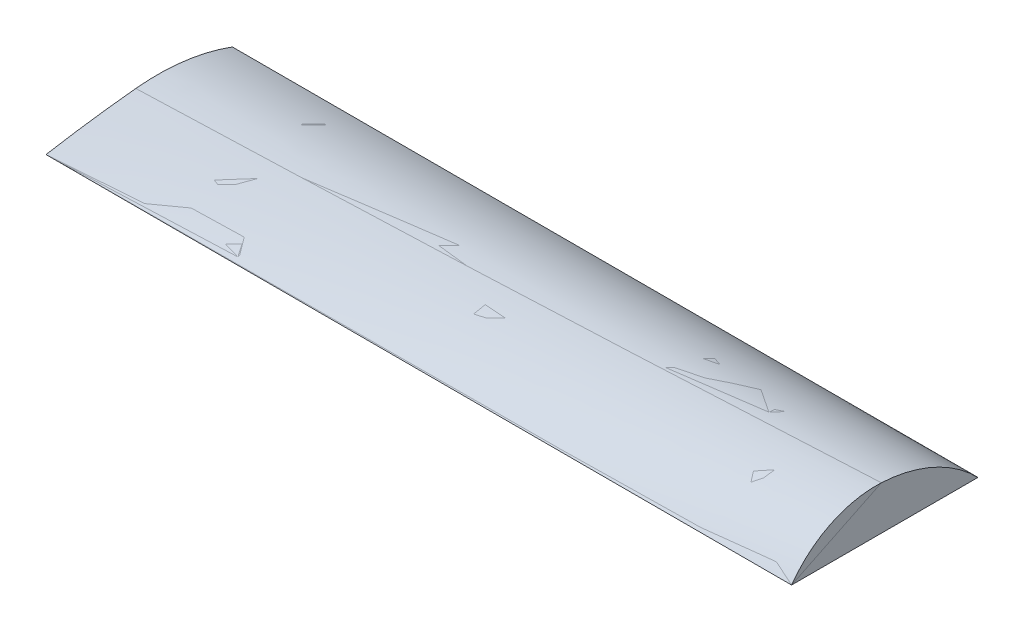
ISO-10303-21;
HEADER;
FILE_DESCRIPTION(('STEP AP214'),'2;1');
FILE_NAME('part.step','',(''),(''),'','','');
FILE_SCHEMA(('AUTOMOTIVE_DESIGN { 1 0 10303 214 1 1 1 1 }'));
ENDSEC;
DATA;
#1=APPLICATION_CONTEXT('core data for automotive mechanical design processes');
#2=APPLICATION_PROTOCOL_DEFINITION('international standard','automotive_design',2000,#1);
#3=PRODUCT_CONTEXT('',#1,'mechanical');
#4=PRODUCT('Part','Part','',(#3));
#5=PRODUCT_RELATED_PRODUCT_CATEGORY('part','',(#4));
#6=PRODUCT_DEFINITION_FORMATION('','',#4);
#7=PRODUCT_DEFINITION_CONTEXT('part definition',#1,'design');
#8=PRODUCT_DEFINITION('design','',#6,#7);
#9=PRODUCT_DEFINITION_SHAPE('','',#8);
#10=(LENGTH_UNIT() NAMED_UNIT(*) SI_UNIT(.MILLI.,.METRE.));
#11=(NAMED_UNIT(*) PLANE_ANGLE_UNIT() SI_UNIT($,.RADIAN.));
#12=(NAMED_UNIT(*) SI_UNIT($,.STERADIAN.) SOLID_ANGLE_UNIT());
#13=UNCERTAINTY_MEASURE_WITH_UNIT(LENGTH_MEASURE(1.E-05),#10,'distance_accuracy_value','');
#14=(GEOMETRIC_REPRESENTATION_CONTEXT(3) GLOBAL_UNCERTAINTY_ASSIGNED_CONTEXT((#13)) GLOBAL_UNIT_ASSIGNED_CONTEXT((#10,
#11,#12)) REPRESENTATION_CONTEXT('',''));
#15=CARTESIAN_POINT('',(0.,0.,0.));
#16=DIRECTION('',(0.,0.,1.));
#17=DIRECTION('',(1.,0.,0.));
#18=AXIS2_PLACEMENT_3D('',#15,#16,#17);
#19=CARTESIAN_POINT('',(3048.,357.029468650609,27.7196009830328));
#20=CARTESIAN_POINT('',(2032.06565410916,305.807060138827,27.7196009830331));
#21=CARTESIAN_POINT('',(0.459460026641767,203.375477990563,27.7196009830337));
#22=CARTESIAN_POINT('',(-2031.93437981395,135.09915754925,27.7196009830325));
#23=CARTESIAN_POINT('',(-3048.,100.965408217149,27.7196009830318));
#24=CARTESIAN_POINT('',(3048.,355.088474416726,-9.18765761877458));
#25=CARTESIAN_POINT('',(2032.06565410916,305.416517274933,-8.33612498554589));
#26=CARTESIAN_POINT('',(0.459460026641767,206.085437260132,-6.63327973857884));
#27=CARTESIAN_POINT('',(-2031.93437981395,138.256317849937,-5.9257886405661));
#28=CARTESIAN_POINT('',(-3048.,104.346140142649,-5.57208879795351));
#29=CARTESIAN_POINT('',(3048.,347.771369274783,-82.8214757845803));
#30=CARTESIAN_POINT('',(2032.06565410916,301.400034870182,-80.4082955218791));
#31=CARTESIAN_POINT('',(0.459460026641989,208.669347512968,-75.5825585153776));
#32=CARTESIAN_POINT('',(-2031.93437981395,142.356994766912,-73.426514928613));
#33=CARTESIAN_POINT('',(-3048.,109.205102403273,-72.3486324231701));
#34=CARTESIAN_POINT('',(3048.,326.584084138001,-191.775336090493));
#35=CARTESIAN_POINT('',(2032.06565410916,285.718343395966,-187.533693604311));
#36=CARTESIAN_POINT('',(0.459460026641101,203.997420825434,-179.051504589966));
#37=CARTESIAN_POINT('',(-2031.93437981395,141.843835621411,-174.860976147701));
#38=CARTESIAN_POINT('',(-3048.,110.771058357894,-172.765982649329));
#39=CARTESIAN_POINT('',(3048.,295.369062928028,-298.290389942061));
#40=CARTESIAN_POINT('',(2032.06565410916,260.50899486405,-292.819188382958));
#41=CARTESIAN_POINT('',(0.459460026640546,190.797865900481,-281.878198916951));
#42=CARTESIAN_POINT('',(-2031.93437981395,134.663233778749,-276.03175468013));
#43=CARTESIAN_POINT('',(-3048.,106.599544211004,-273.108910262419));
#44=CARTESIAN_POINT('',(3047.99999999999,254.39579806938,-401.445762945769));
#45=CARTESIAN_POINT('',(2032.06565410915,225.974502752165,-395.42274883089));
#46=CARTESIAN_POINT('',(0.459460026644765,169.139255628326,-383.378276830975));
#47=CARTESIAN_POINT('',(-2031.93437981395,120.853606673482,-376.493025001473));
#48=CARTESIAN_POINT('',(-3048.,96.7139016174797,-373.050843898016));
#49=CARTESIAN_POINT('',(3048.00000000001,204.018747874501,-500.349717499533));
#50=CARTESIAN_POINT('',(2032.06565410916,182.393619242813,-494.524216022473));
#51=CARTESIAN_POINT('',(0.459460026640546,139.148949492579,-482.874718264766));
#52=CARTESIAN_POINT('',(-2031.93437981395,100.472965583307,-475.801409575772));
#53=CARTESIAN_POINT('',(-3048.,81.1374722321939,-472.265212191698));
#54=CARTESIAN_POINT('',(3047.99999999999,144.673229990741,-594.147072223697));
#55=CARTESIAN_POINT('',(2032.06565410915,130.115112109361,-589.331310253587));
#56=CARTESIAN_POINT('',(0.459460026644321,101.002637881453,-579.701030612708));
#57=CARTESIAN_POINT('',(-2031.93437981395,73.6195841472809,-573.52012772952));
#58=CARTESIAN_POINT('',(-3048.,59.9298263210211,-570.43007559582));
#59=CARTESIAN_POINT('',(3048.00000000001,76.8725640331372,-682.027186144494));
#60=CARTESIAN_POINT('',(2032.06565410916,69.5587832278572,-679.086866649359));
#61=CARTESIAN_POINT('',(0.459460026639436,54.9331113561778,-673.206987380527));
#62=CARTESIAN_POINT('',(-2031.93437981395,40.4107677559007,-669.21782035926));
#63=CARTESIAN_POINT('',(-3048.,33.1505341498355,-667.223494562737));
#64=CARTESIAN_POINT('',(3048.,26.4258089430827,-736.162240464383));
#65=CARTESIAN_POINT('',(2032.06565410916,23.9914846027125,-735.077740652571));
#66=CARTESIAN_POINT('',(0.459460026641767,19.1234649040918,-732.90902124263));
#67=CARTESIAN_POINT('',(-2031.93437981395,14.1394388830836,-731.389406125531));
#68=CARTESIAN_POINT('',(-3048.,11.6477478580526,-730.629696739421));
#69=CARTESIAN_POINT('',(3048.,2.22044604925031E-13,-762.));
#70=CARTESIAN_POINT('',(2032.06565410916,0.,-762.));
#71=CARTESIAN_POINT('',(0.459460026641767,-4.99617109103717E-13,-762.000000000001));
#72=CARTESIAN_POINT('',(-2031.93437981395,1.29547534353127E-13,-762.));
#73=CARTESIAN_POINT('',(-3048.,4.44089209850063E-13,-762.));
#74=B_SPLINE_SURFACE_WITH_KNOTS('',3,3,((#19,#20,#21,#22,#23),(#24,#25,#26,#27,#28),(#29,#30,
#31,#32,#33),(#34,#35,#36,#37,#38),(#39,#40,#41,#42,#43),(#44,#45,#46,#47,#48),(#49,#50,#51,#52,
#53),(#54,#55,#56,#57,#58),(#59,#60,#61,#62,#63),(#64,#65,#66,#67,#68),(#69,#70,#71,#72,#73)),
.UNSPECIFIED.,.F.,.F.,.F.,(4,1,1,1,1,1,1,1,4),(4,1,4),(0.,0.125,0.25,0.375,0.5,0.625,0.75,0.875,
1.),(0.,0.500064603489578,1.),.UNSPECIFIED.);
#75=CARTESIAN_POINT('',(3048.,-833.356731227227,90.3233498819976));
#76=DIRECTION('',(-1.,0.,0.));
#77=DIRECTION('',(0.,0.,-1.));
#78=AXIS2_PLACEMENT_3D('',#75,#76,#77);
#79=CIRCLE('',#78,1192.03126395066);
#80=CARTESIAN_POINT('',(3048.,357.029468650609,27.7196009830328));
#81=VERTEX_POINT('',#80);
#82=CARTESIAN_POINT('',(3048.,2.22044604925031E-13,-762.));
#83=VERTEX_POINT('',#82);
#84=EDGE_CURVE('E173',#81,#83,#79,.T.);
#85=DIRECTION('',(-1.,0.,0.));
#86=VECTOR('',#85,1.);
#87=CARTESIAN_POINT('',(0.393822875752819,0.,-762.));
#88=LINE('',#87,#86);
#89=CARTESIAN_POINT('',(-3048.,2.22044604925031E-13,-762.));
#90=VERTEX_POINT('',#89);
#91=EDGE_CURVE('E176',#83,#90,#88,.T.);
#92=CARTESIAN_POINT('',(-3048.,-1648.45305250207,-149.931785297438));
#93=DIRECTION('',(-1.,0.,0.));
#94=DIRECTION('',(0.,0.,-1.));
#95=AXIS2_PLACEMENT_3D('',#92,#93,#94);
#96=CIRCLE('',#95,1758.41547017551);
#97=CARTESIAN_POINT('',(-3048.,100.965408217149,27.7196009830318));
#98=VERTEX_POINT('',#97);
#99=EDGE_CURVE('E191',#98,#90,#96,.T.);
#100=CARTESIAN_POINT('',(3048.,357.029468650609,27.7196009830328));
#101=CARTESIAN_POINT('',(2032.06565410916,305.807060138827,27.7196009830331));
#102=CARTESIAN_POINT('',(0.459460026641767,203.375477990563,27.7196009830336));
#103=CARTESIAN_POINT('',(-2031.93437981395,135.09915754925,27.7196009830324));
#104=CARTESIAN_POINT('',(-3048.,100.965408217149,27.7196009830318));
#105=B_SPLINE_CURVE_WITH_KNOTS('',3,(#100,#101,#102,#103,#104),.UNSPECIFIED.,.F.,.F.,(4,1,4),
(0.,0.500064603489578,1.),.UNSPECIFIED.);
#106=EDGE_CURVE('E179',#81,#98,#105,.T.);
#107=ORIENTED_EDGE('',*,*,#84,.T.);
#108=ORIENTED_EDGE('',*,*,#91,.T.);
#109=ORIENTED_EDGE('',*,*,#99,.F.);
#110=ORIENTED_EDGE('',*,*,#106,.F.);
#111=EDGE_LOOP('',(#107,#108,#109,#110));
#112=FACE_BOUND('',#111,.T.);
#113=ADVANCED_FACE('F133',(#112),#74,.T.);
#114=CARTESIAN_POINT('',(3048.,1.66533453693773E-13,762.));
#115=CARTESIAN_POINT('',(2032.06565410916,2.0817458848352E-13,762.));
#116=CARTESIAN_POINT('',(0.459460026641767,2.91446098802716E-13,761.999999999999));
#117=CARTESIAN_POINT('',(-2031.93437981395,0.,762.));
#118=CARTESIAN_POINT('',(-3048.,0.,762.));
#119=CARTESIAN_POINT('',(3048.,29.0429711531695,741.566544907392));
#120=CARTESIAN_POINT('',(2032.06565410916,24.2371026730112,738.550355351954));
#121=CARTESIAN_POINT('',(0.459460026641767,14.6266074557498,732.518755565864));
#122=CARTESIAN_POINT('',(-2031.93437981395,8.4016222990255,731.884160631592));
#123=CARTESIAN_POINT('',(-3048.,5.28953187642705,731.566904161504));
#124=CARTESIAN_POINT('',(3048.,84.5453723552376,697.027775172461));
#125=CARTESIAN_POINT('',(2032.06565410916,70.4457511191001,689.08358478242));
#126=CARTESIAN_POINT('',(0.459460026641323,42.2501517150495,673.197256626809));
#127=CARTESIAN_POINT('',(-2031.93437981395,24.4819010655734,671.501573315269));
#128=CARTESIAN_POINT('',(-3048.,15.5989236318311,670.653841206558));
#129=CARTESIAN_POINT('',(3048.,158.721372485365,620.265381851068));
#130=CARTESIAN_POINT('',(2032.06565410916,132.12375937084,607.933020626898));
#131=CARTESIAN_POINT('',(0.459460026642766,78.9354054483259,583.271484621126));
#132=CARTESIAN_POINT('',(-2031.93437981395,46.4789445969054,580.524251156607));
#133=CARTESIAN_POINT('',(-3048.,30.2528109718255,579.150811905216));
#134=CARTESIAN_POINT('',(3048.00000000001,222.639379242981,534.772697088081));
#135=CARTESIAN_POINT('',(2032.06565410916,185.414016794622,520.678936224319));
#136=CARTESIAN_POINT('',(0.459460026639769,110.972910208411,492.495056050811));
#137=CARTESIAN_POINT('',(-2031.93437981395,66.3859255649033,489.179227007448));
#138=CARTESIAN_POINT('',(-3048.,44.0953137179471,487.521526699893));
#139=CARTESIAN_POINT('',(3047.99999999999,275.280986029378,441.910495941741));
#140=CARTESIAN_POINT('',(2032.06565410915,229.67378287563,428.254517465996));
#141=CARTESIAN_POINT('',(0.459460026644987,138.47116058345,400.94608895406));
#142=CARTESIAN_POINT('',(-2031.93437981395,84.238303362931,397.497337764328));
#143=CARTESIAN_POINT('',(-3048.,57.1253783844976,395.773184970824));
#144=CARTESIAN_POINT('',(3048.,315.808296145767,343.157955207196));
#145=CARTESIAN_POINT('',(2032.06565410916,264.365612597069,331.662016648247));
#146=CARTESIAN_POINT('',(0.459460026640768,161.493537289764,308.67310985755));
#147=CARTESIAN_POINT('',(-2031.93437981395,100.056500722473,305.499557336302));
#148=CARTESIAN_POINT('',(-3048.,69.3419514857788,303.912986098246));
#149=CARTESIAN_POINT('',(3048.,343.575379924687,240.087591890367));
#150=CARTESIAN_POINT('',(2032.06565410916,289.07946806479,231.962587520926));
#151=CARTESIAN_POINT('',(0.459460026640768,180.101725029969,215.714678125336));
#152=CARTESIAN_POINT('',(-2031.93437981395,113.860458253997,213.203548966914));
#153=CARTESIAN_POINT('',(-3048.,80.7441042829981,211.94814661541));
#154=CARTESIAN_POINT('',(3047.99999999999,358.140910336441,134.340774692125));
#155=CARTESIAN_POINT('',(2032.06565410915,303.52466072033,130.257546581266));
#156=CARTESIAN_POINT('',(0.459460026642988,194.306273266018,122.092145386369));
#157=CARTESIAN_POINT('',(-2031.93437981395,125.653072956041,120.621240482108));
#158=CARTESIAN_POINT('',(-3048.,91.3309080373627,119.885883055567));
#159=CARTESIAN_POINT('',(3048.,358.894446710407,63.1814412802017));
#160=CARTESIAN_POINT('',(2032.06565410916,306.207053153412,61.8698764540038));
#161=CARTESIAN_POINT('',(0.459460026641767,200.845879438396,59.2470856844804));
#162=CARTESIAN_POINT('',(-2031.93437981395,132.1754553575,58.7162808688702));
#163=CARTESIAN_POINT('',(-3048.,97.8446796660789,58.4509127529084));
#164=CARTESIAN_POINT('',(3048.,357.029468650609,27.7196009830328));
#165=CARTESIAN_POINT('',(2032.06565410916,305.807060138827,27.7196009830331));
#166=CARTESIAN_POINT('',(0.459460026641767,203.375477990563,27.7196009830336));
#167=CARTESIAN_POINT('',(-2031.93437981395,135.09915754925,27.7196009830324));
#168=CARTESIAN_POINT('',(-3048.,100.965408217149,27.7196009830318));
#169=B_SPLINE_SURFACE_WITH_KNOTS('',3,3,((#114,#115,#116,#117,#118),(#119,#120,#121,#122,#123),
(#124,#125,#126,#127,#128),(#129,#130,#131,#132,#133),(#134,#135,#136,#137,#138),(#139,#140,
#141,#142,#143),(#144,#145,#146,#147,#148),(#149,#150,#151,#152,#153),(#154,#155,#156,#157,
#158),(#159,#160,#161,#162,#163),(#164,#165,#166,#167,#168)),.UNSPECIFIED.,.F.,.F.,.F.,(4,1,1,1,
1,1,1,1,4),(4,1,4),(0.,0.125,0.25,0.375,0.5,0.625,0.75,0.875,1.),(0.,0.500064603489578,1.),.UNSPECIFIED.);
#170=CARTESIAN_POINT('',(3048.,-485.437757623856,72.0258998083268));
#171=DIRECTION('',(-1.,0.,0.));
#172=DIRECTION('',(0.,0.,-1.));
#173=AXIS2_PLACEMENT_3D('',#170,#171,#172);
#174=CIRCLE('',#173,843.631480838753);
#175=CARTESIAN_POINT('',(3048.,1.66533453693773E-13,762.));
#176=VERTEX_POINT('',#175);
#177=EDGE_CURVE('E150',#176,#81,#174,.T.);
#178=CARTESIAN_POINT('',(-3048.,-10303.5740928413,-1028.84914313158));
#179=DIRECTION('',(-1.,0.,0.));
#180=DIRECTION('',(0.,0.,-1.));
#181=AXIS2_PLACEMENT_3D('',#178,#179,#180);
#182=CIRCLE('',#181,10458.048562716);
#183=CARTESIAN_POINT('',(-3048.,0.,762.));
#184=VERTEX_POINT('',#183);
#185=EDGE_CURVE('E158',#184,#98,#182,.T.);
#186=DIRECTION('',(-1.,0.,0.));
#187=VECTOR('',#186,1.);
#188=CARTESIAN_POINT('',(0.393822875752819,2.22055364725921E-13,761.999999999999));
#189=LINE('',#188,#187);
#190=EDGE_CURVE('E235',#176,#184,#189,.T.);
#191=ORIENTED_EDGE('',*,*,#177,.T.);
#192=ORIENTED_EDGE('',*,*,#106,.T.);
#193=ORIENTED_EDGE('',*,*,#185,.F.);
#194=ORIENTED_EDGE('',*,*,#190,.F.);
#195=EDGE_LOOP('',(#191,#192,#193,#194));
#196=FACE_BOUND('',#195,.T.);
#197=ADVANCED_FACE('F264',(#196),#169,.T.);
#198=CARTESIAN_POINT('',(-3048.,-10303.5740928413,-1028.84914313158));
#199=DIRECTION('',(-1.,0.,0.));
#200=DIRECTION('',(0.,0.,1.));
#201=AXIS2_PLACEMENT_3D('',#198,#199,#200);
#202=PLANE('',#201);
#203=ORIENTED_EDGE('',*,*,#99,.T.);
#204=DIRECTION('',(0.,0.,1.));
#205=VECTOR('',#204,1.);
#206=CARTESIAN_POINT('',(-3048.,1.11022302462516E-13,0.));
#207=LINE('',#206,#205);
#208=EDGE_CURVE('E143',#90,#184,#207,.T.);
#209=ORIENTED_EDGE('',*,*,#208,.T.);
#210=ORIENTED_EDGE('',*,*,#185,.T.);
#211=EDGE_LOOP('',(#203,#209,#210));
#212=FACE_BOUND('',#211,.T.);
#213=ADVANCED_FACE('F245',(#212),#202,.T.);
#214=CARTESIAN_POINT('',(3048.,2.22044604925031E-13,-762.));
#215=DIRECTION('',(0.,-1.,0.));
#216=DIRECTION('',(0.,0.,1.));
#217=AXIS2_PLACEMENT_3D('',#214,#215,#216);
#218=PLANE('',#217);
#219=DIRECTION('',(0.,0.,1.));
#220=VECTOR('',#219,1.);
#221=CARTESIAN_POINT('',(3048.,1.11022302462516E-13,0.));
#222=LINE('',#221,#220);
#223=EDGE_CURVE('E13',#83,#176,#222,.T.);
#224=ORIENTED_EDGE('',*,*,#223,.T.);
#225=ORIENTED_EDGE('',*,*,#190,.T.);
#226=ORIENTED_EDGE('',*,*,#208,.F.);
#227=ORIENTED_EDGE('',*,*,#91,.F.);
#228=EDGE_LOOP('',(#224,#225,#226,#227));
#229=FACE_BOUND('',#228,.T.);
#230=ADVANCED_FACE('F187',(#229),#218,.T.);
#231=CARTESIAN_POINT('',(3048.,-485.437757623856,72.0258998083268));
#232=DIRECTION('',(-1.,0.,0.));
#233=DIRECTION('',(0.,0.,1.));
#234=AXIS2_PLACEMENT_3D('',#231,#232,#233);
#235=PLANE('',#234);
#236=ORIENTED_EDGE('',*,*,#177,.F.);
#237=ORIENTED_EDGE('',*,*,#223,.F.);
#238=ORIENTED_EDGE('',*,*,#84,.F.);
#239=EDGE_LOOP('',(#236,#237,#238));
#240=FACE_BOUND('',#239,.T.);
#241=ADVANCED_FACE('F135',(#240),#235,.F.);
#242=CLOSED_SHELL('',(#113,#197,#213,#230,#241));
#243=MANIFOLD_SOLID_BREP('B2',#242);
#244=CARTESIAN_POINT('',(3048.,357.029468650609,27.7196009830328));
#245=CARTESIAN_POINT('',(2032.06565410916,305.807060138827,27.7196009830331));
#246=CARTESIAN_POINT('',(0.459460026641767,203.375477990563,27.7196009830337));
#247=CARTESIAN_POINT('',(-2031.93437981395,135.09915754925,27.7196009830325));
#248=CARTESIAN_POINT('',(-3048.,100.965408217149,27.7196009830318));
#249=CARTESIAN_POINT('',(3048.,355.088474416726,-9.18765761877458));
#250=CARTESIAN_POINT('',(2032.06565410916,305.416517274933,-8.33612498554589));
#251=CARTESIAN_POINT('',(0.459460026641767,206.085437260132,-6.63327973857884));
#252=CARTESIAN_POINT('',(-2031.93437981395,138.256317849937,-5.9257886405661));
#253=CARTESIAN_POINT('',(-3048.,104.346140142649,-5.57208879795351));
#254=CARTESIAN_POINT('',(3048.,347.771369274783,-82.8214757845803));
#255=CARTESIAN_POINT('',(2032.06565410916,301.400034870182,-80.4082955218791));
#256=CARTESIAN_POINT('',(0.459460026641989,208.669347512968,-75.5825585153776));
#257=CARTESIAN_POINT('',(-2031.93437981395,142.356994766912,-73.426514928613));
#258=CARTESIAN_POINT('',(-3048.,109.205102403273,-72.3486324231701));
#259=CARTESIAN_POINT('',(3048.,326.584084138001,-191.775336090493));
#260=CARTESIAN_POINT('',(2032.06565410916,285.718343395966,-187.533693604311));
#261=CARTESIAN_POINT('',(0.459460026641101,203.997420825434,-179.051504589966));
#262=CARTESIAN_POINT('',(-2031.93437981395,141.843835621411,-174.860976147701));
#263=CARTESIAN_POINT('',(-3048.,110.771058357894,-172.765982649329));
#264=CARTESIAN_POINT('',(3048.,295.369062928028,-298.290389942061));
#265=CARTESIAN_POINT('',(2032.06565410916,260.50899486405,-292.819188382958));
#266=CARTESIAN_POINT('',(0.459460026640546,190.797865900481,-281.878198916951));
#267=CARTESIAN_POINT('',(-2031.93437981395,134.663233778749,-276.03175468013));
#268=CARTESIAN_POINT('',(-3048.,106.599544211004,-273.108910262419));
#269=CARTESIAN_POINT('',(3047.99999999999,254.39579806938,-401.445762945769));
#270=CARTESIAN_POINT('',(2032.06565410915,225.974502752165,-395.42274883089));
#271=CARTESIAN_POINT('',(0.459460026644765,169.139255628326,-383.378276830975));
#272=CARTESIAN_POINT('',(-2031.93437981395,120.853606673482,-376.493025001473));
#273=CARTESIAN_POINT('',(-3048.,96.7139016174797,-373.050843898016));
#274=CARTESIAN_POINT('',(3048.00000000001,204.018747874501,-500.349717499533));
#275=CARTESIAN_POINT('',(2032.06565410916,182.393619242813,-494.524216022473));
#276=CARTESIAN_POINT('',(0.459460026640546,139.148949492579,-482.874718264766));
#277=CARTESIAN_POINT('',(-2031.93437981395,100.472965583307,-475.801409575772));
#278=CARTESIAN_POINT('',(-3048.,81.1374722321939,-472.265212191698));
#279=CARTESIAN_POINT('',(3047.99999999999,144.673229990741,-594.147072223697));
#280=CARTESIAN_POINT('',(2032.06565410915,130.115112109361,-589.331310253587));
#281=CARTESIAN_POINT('',(0.459460026644321,101.002637881453,-579.701030612708));
#282=CARTESIAN_POINT('',(-2031.93437981395,73.6195841472809,-573.52012772952));
#283=CARTESIAN_POINT('',(-3048.,59.9298263210211,-570.43007559582));
#284=CARTESIAN_POINT('',(3048.00000000001,76.8725640331372,-682.027186144494));
#285=CARTESIAN_POINT('',(2032.06565410916,69.5587832278572,-679.086866649359));
#286=CARTESIAN_POINT('',(0.459460026639436,54.9331113561778,-673.206987380527));
#287=CARTESIAN_POINT('',(-2031.93437981395,40.4107677559007,-669.21782035926));
#288=CARTESIAN_POINT('',(-3048.,33.1505341498355,-667.223494562737));
#289=CARTESIAN_POINT('',(3048.,26.4258089430827,-736.162240464383));
#290=CARTESIAN_POINT('',(2032.06565410916,23.9914846027125,-735.077740652571));
#291=CARTESIAN_POINT('',(0.459460026641767,19.1234649040918,-732.90902124263));
#292=CARTESIAN_POINT('',(-2031.93437981395,14.1394388830836,-731.389406125531));
#293=CARTESIAN_POINT('',(-3048.,11.6477478580526,-730.629696739421));
#294=CARTESIAN_POINT('',(3048.,2.22044604925031E-13,-762.));
#295=CARTESIAN_POINT('',(2032.06565410916,0.,-762.));
#296=CARTESIAN_POINT('',(0.459460026641767,-4.99617109103717E-13,-762.000000000001));
#297=CARTESIAN_POINT('',(-2031.93437981395,1.29547534353127E-13,-762.));
#298=CARTESIAN_POINT('',(-3048.,4.44089209850063E-13,-762.));
#299=B_SPLINE_SURFACE_WITH_KNOTS('',3,3,((#244,#245,#246,#247,#248),(#249,#250,#251,#252,#253),
(#254,#255,#256,#257,#258),(#259,#260,#261,#262,#263),(#264,#265,#266,#267,#268),(#269,#270,
#271,#272,#273),(#274,#275,#276,#277,#278),(#279,#280,#281,#282,#283),(#284,#285,#286,#287,
#288),(#289,#290,#291,#292,#293),(#294,#295,#296,#297,#298)),.UNSPECIFIED.,.F.,.F.,.F.,(4,1,1,1,
1,1,1,1,4),(4,1,4),(0.,0.125,0.25,0.375,0.5,0.625,0.75,0.875,1.),(0.,0.500064603489578,1.),.UNSPECIFIED.);
#300=CARTESIAN_POINT('',(3048.,-833.356731227227,90.3233498819976));
#301=DIRECTION('',(-1.,0.,0.));
#302=DIRECTION('',(0.,0.,-1.));
#303=AXIS2_PLACEMENT_3D('',#300,#301,#302);
#304=CIRCLE('',#303,1192.03126395066);
#305=CARTESIAN_POINT('',(3048.,357.029468650609,27.7196009830328));
#306=VERTEX_POINT('',#305);
#307=CARTESIAN_POINT('',(3048.,2.22044604925031E-13,-762.));
#308=VERTEX_POINT('',#307);
#309=EDGE_CURVE('E131',#306,#308,#304,.T.);
#310=DIRECTION('',(-1.,0.,0.));
#311=VECTOR('',#310,1.);
#312=CARTESIAN_POINT('',(0.393822875752819,0.,-762.));
#313=LINE('',#312,#311);
#314=CARTESIAN_POINT('',(-3048.,2.22044604925031E-13,-762.));
#315=VERTEX_POINT('',#314);
#316=EDGE_CURVE('E461',#308,#315,#313,.T.);
#317=CARTESIAN_POINT('',(-3048.,-1648.45305250207,-149.931785297438));
#318=DIRECTION('',(-1.,0.,0.));
#319=DIRECTION('',(0.,0.,-1.));
#320=AXIS2_PLACEMENT_3D('',#317,#318,#319);
#321=CIRCLE('',#320,1758.41547017551);
#322=CARTESIAN_POINT('',(-3048.,100.965408217149,27.7196009830318));
#323=VERTEX_POINT('',#322);
#324=EDGE_CURVE('E514',#323,#315,#321,.T.);
#325=CARTESIAN_POINT('',(3048.,357.029468650609,27.7196009830328));
#326=CARTESIAN_POINT('',(2032.06565410916,305.807060138827,27.7196009830331));
#327=CARTESIAN_POINT('',(0.459460026641767,203.375477990563,27.7196009830336));
#328=CARTESIAN_POINT('',(-2031.93437981395,135.09915754925,27.7196009830324));
#329=CARTESIAN_POINT('',(-3048.,100.965408217149,27.7196009830318));
#330=B_SPLINE_CURVE_WITH_KNOTS('',3,(#325,#326,#327,#328,#329),.UNSPECIFIED.,.F.,.F.,(4,1,4),
(0.,0.500064603489578,1.),.UNSPECIFIED.);
#331=EDGE_CURVE('E495',#306,#323,#330,.T.);
#332=ORIENTED_EDGE('',*,*,#309,.T.);
#333=ORIENTED_EDGE('',*,*,#316,.T.);
#334=ORIENTED_EDGE('',*,*,#324,.F.);
#335=ORIENTED_EDGE('',*,*,#331,.F.);
#336=EDGE_LOOP('',(#332,#333,#334,#335));
#337=FACE_BOUND('',#336,.T.);
#338=ADVANCED_FACE('F448',(#337),#299,.T.);
#339=CARTESIAN_POINT('',(3048.,2.22044604925031E-13,-762.));
#340=DIRECTION('',(0.,-1.,0.));
#341=DIRECTION('',(0.,0.,1.));
#342=AXIS2_PLACEMENT_3D('',#339,#340,#341);
#343=PLANE('',#342);
#344=DIRECTION('',(0.,0.,1.));
#345=VECTOR('',#344,1.);
#346=CARTESIAN_POINT('',(3048.,1.11022302462516E-13,0.));
#347=LINE('',#346,#345);
#348=CARTESIAN_POINT('',(3048.,1.66533453693773E-13,762.));
#349=VERTEX_POINT('',#348);
#350=EDGE_CURVE('E470',#308,#349,#347,.T.);
#351=ORIENTED_EDGE('',*,*,#350,.T.);
#352=DIRECTION('',(-1.,0.,0.));
#353=VECTOR('',#352,1.);
#354=CARTESIAN_POINT('',(0.393822875752819,2.22055364725921E-13,761.999999999999));
#355=LINE('',#354,#353);
#356=CARTESIAN_POINT('',(-3048.,0.,762.));
#357=VERTEX_POINT('',#356);
#358=EDGE_CURVE('E498',#349,#357,#355,.T.);
#359=ORIENTED_EDGE('',*,*,#358,.T.);
#360=DIRECTION('',(0.,0.,1.));
#361=VECTOR('',#360,1.);
#362=CARTESIAN_POINT('',(-3048.,1.11022302462516E-13,0.));
#363=LINE('',#362,#361);
#364=EDGE_CURVE('E628',#315,#357,#363,.T.);
#365=ORIENTED_EDGE('',*,*,#364,.F.);
#366=ORIENTED_EDGE('',*,*,#316,.F.);
#367=EDGE_LOOP('',(#351,#359,#365,#366));
#368=FACE_BOUND('',#367,.T.);
#369=ADVANCED_FACE('F450',(#368),#343,.T.);
#370=CARTESIAN_POINT('',(3048.,1.66533453693773E-13,762.));
#371=CARTESIAN_POINT('',(2032.06565410916,2.0817458848352E-13,762.));
#372=CARTESIAN_POINT('',(0.459460026641767,2.91446098802716E-13,761.999999999999));
#373=CARTESIAN_POINT('',(-2031.93437981395,0.,762.));
#374=CARTESIAN_POINT('',(-3048.,0.,762.));
#375=CARTESIAN_POINT('',(3048.,29.0429711531695,741.566544907392));
#376=CARTESIAN_POINT('',(2032.06565410916,24.2371026730112,738.550355351954));
#377=CARTESIAN_POINT('',(0.459460026641767,14.6266074557498,732.518755565864));
#378=CARTESIAN_POINT('',(-2031.93437981395,8.4016222990255,731.884160631592));
#379=CARTESIAN_POINT('',(-3048.,5.28953187642705,731.566904161504));
#380=CARTESIAN_POINT('',(3048.,84.5453723552376,697.027775172461));
#381=CARTESIAN_POINT('',(2032.06565410916,70.4457511191001,689.08358478242));
#382=CARTESIAN_POINT('',(0.459460026641323,42.2501517150495,673.197256626809));
#383=CARTESIAN_POINT('',(-2031.93437981395,24.4819010655734,671.501573315269));
#384=CARTESIAN_POINT('',(-3048.,15.5989236318311,670.653841206558));
#385=CARTESIAN_POINT('',(3048.,158.721372485365,620.265381851068));
#386=CARTESIAN_POINT('',(2032.06565410916,132.12375937084,607.933020626898));
#387=CARTESIAN_POINT('',(0.459460026642766,78.9354054483259,583.271484621126));
#388=CARTESIAN_POINT('',(-2031.93437981395,46.4789445969054,580.524251156607));
#389=CARTESIAN_POINT('',(-3048.,30.2528109718255,579.150811905216));
#390=CARTESIAN_POINT('',(3048.00000000001,222.639379242981,534.772697088081));
#391=CARTESIAN_POINT('',(2032.06565410916,185.414016794622,520.678936224319));
#392=CARTESIAN_POINT('',(0.459460026639769,110.972910208411,492.495056050811));
#393=CARTESIAN_POINT('',(-2031.93437981395,66.3859255649033,489.179227007448));
#394=CARTESIAN_POINT('',(-3048.,44.0953137179471,487.521526699893));
#395=CARTESIAN_POINT('',(3047.99999999999,275.280986029378,441.910495941741));
#396=CARTESIAN_POINT('',(2032.06565410915,229.67378287563,428.254517465996));
#397=CARTESIAN_POINT('',(0.459460026644987,138.47116058345,400.94608895406));
#398=CARTESIAN_POINT('',(-2031.93437981395,84.238303362931,397.497337764328));
#399=CARTESIAN_POINT('',(-3048.,57.1253783844976,395.773184970824));
#400=CARTESIAN_POINT('',(3048.,315.808296145767,343.157955207196));
#401=CARTESIAN_POINT('',(2032.06565410916,264.365612597069,331.662016648247));
#402=CARTESIAN_POINT('',(0.459460026640768,161.493537289764,308.67310985755));
#403=CARTESIAN_POINT('',(-2031.93437981395,100.056500722473,305.499557336302));
#404=CARTESIAN_POINT('',(-3048.,69.3419514857788,303.912986098246));
#405=CARTESIAN_POINT('',(3048.,343.575379924687,240.087591890367));
#406=CARTESIAN_POINT('',(2032.06565410916,289.07946806479,231.962587520926));
#407=CARTESIAN_POINT('',(0.459460026640768,180.101725029969,215.714678125336));
#408=CARTESIAN_POINT('',(-2031.93437981395,113.860458253997,213.203548966914));
#409=CARTESIAN_POINT('',(-3048.,80.7441042829981,211.94814661541));
#410=CARTESIAN_POINT('',(3047.99999999999,358.140910336441,134.340774692125));
#411=CARTESIAN_POINT('',(2032.06565410915,303.52466072033,130.257546581266));
#412=CARTESIAN_POINT('',(0.459460026642988,194.306273266018,122.092145386369));
#413=CARTESIAN_POINT('',(-2031.93437981395,125.653072956041,120.621240482108));
#414=CARTESIAN_POINT('',(-3048.,91.3309080373627,119.885883055567));
#415=CARTESIAN_POINT('',(3048.,358.894446710407,63.1814412802017));
#416=CARTESIAN_POINT('',(2032.06565410916,306.207053153412,61.8698764540038));
#417=CARTESIAN_POINT('',(0.459460026641767,200.845879438396,59.2470856844804));
#418=CARTESIAN_POINT('',(-2031.93437981395,132.1754553575,58.7162808688702));
#419=CARTESIAN_POINT('',(-3048.,97.8446796660789,58.4509127529084));
#420=CARTESIAN_POINT('',(3048.,357.029468650609,27.7196009830328));
#421=CARTESIAN_POINT('',(2032.06565410916,305.807060138827,27.7196009830331));
#422=CARTESIAN_POINT('',(0.459460026641767,203.375477990563,27.7196009830336));
#423=CARTESIAN_POINT('',(-2031.93437981395,135.09915754925,27.7196009830324));
#424=CARTESIAN_POINT('',(-3048.,100.965408217149,27.7196009830318));
#425=B_SPLINE_SURFACE_WITH_KNOTS('',3,3,((#370,#371,#372,#373,#374),(#375,#376,#377,#378,#379),
(#380,#381,#382,#383,#384),(#385,#386,#387,#388,#389),(#390,#391,#392,#393,#394),(#395,#396,
#397,#398,#399),(#400,#401,#402,#403,#404),(#405,#406,#407,#408,#409),(#410,#411,#412,#413,
#414),(#415,#416,#417,#418,#419),(#420,#421,#422,#423,#424)),.UNSPECIFIED.,.F.,.F.,.F.,(4,1,1,1,
1,1,1,1,4),(4,1,4),(0.,0.125,0.25,0.375,0.5,0.625,0.75,0.875,1.),(0.,0.500064603489578,1.),.UNSPECIFIED.);
#426=CARTESIAN_POINT('',(3048.,-485.437757623856,72.0258998083268));
#427=DIRECTION('',(-1.,0.,0.));
#428=DIRECTION('',(0.,0.,-1.));
#429=AXIS2_PLACEMENT_3D('',#426,#427,#428);
#430=CIRCLE('',#429,843.631480838753);
#431=EDGE_CURVE('E491',#349,#306,#430,.T.);
#432=CARTESIAN_POINT('',(-3048.,-10303.5740928413,-1028.84914313158));
#433=DIRECTION('',(-1.,0.,0.));
#434=DIRECTION('',(0.,0.,-1.));
#435=AXIS2_PLACEMENT_3D('',#432,#433,#434);
#436=CIRCLE('',#435,10458.048562716);
#437=EDGE_CURVE('E484',#357,#323,#436,.T.);
#438=ORIENTED_EDGE('',*,*,#431,.T.);
#439=ORIENTED_EDGE('',*,*,#331,.T.);
#440=ORIENTED_EDGE('',*,*,#437,.F.);
#441=ORIENTED_EDGE('',*,*,#358,.F.);
#442=EDGE_LOOP('',(#438,#439,#440,#441));
#443=FACE_BOUND('',#442,.T.);
#444=ADVANCED_FACE('F493',(#443),#425,.T.);
#445=CARTESIAN_POINT('',(3048.,-485.437757623856,72.0258998083268));
#446=DIRECTION('',(-1.,0.,0.));
#447=DIRECTION('',(0.,0.,1.));
#448=AXIS2_PLACEMENT_3D('',#445,#446,#447);
#449=PLANE('',#448);
#450=ORIENTED_EDGE('',*,*,#431,.F.);
#451=ORIENTED_EDGE('',*,*,#350,.F.);
#452=ORIENTED_EDGE('',*,*,#309,.F.);
#453=EDGE_LOOP('',(#450,#451,#452));
#454=FACE_BOUND('',#453,.T.);
#455=ADVANCED_FACE('F506',(#454),#449,.F.);
#456=CARTESIAN_POINT('',(-3048.,-10303.5740928413,-1028.84914313158));
#457=DIRECTION('',(-1.,0.,0.));
#458=DIRECTION('',(0.,0.,1.));
#459=AXIS2_PLACEMENT_3D('',#456,#457,#458);
#460=PLANE('',#459);
#461=ORIENTED_EDGE('',*,*,#324,.T.);
#462=ORIENTED_EDGE('',*,*,#364,.T.);
#463=ORIENTED_EDGE('',*,*,#437,.T.);
#464=EDGE_LOOP('',(#461,#462,#463));
#465=FACE_BOUND('',#464,.T.);
#466=ADVANCED_FACE('F596',(#465),#460,.T.);
#467=CLOSED_SHELL('',(#338,#369,#444,#455,#466));
#468=MANIFOLD_SOLID_BREP('B7',#467);
#469=ADVANCED_BREP_SHAPE_REPRESENTATION('',(#18,#243,#468),#14);
#470=SHAPE_DEFINITION_REPRESENTATION(#9,#469);
ENDSEC;
END-ISO-10303-21;
